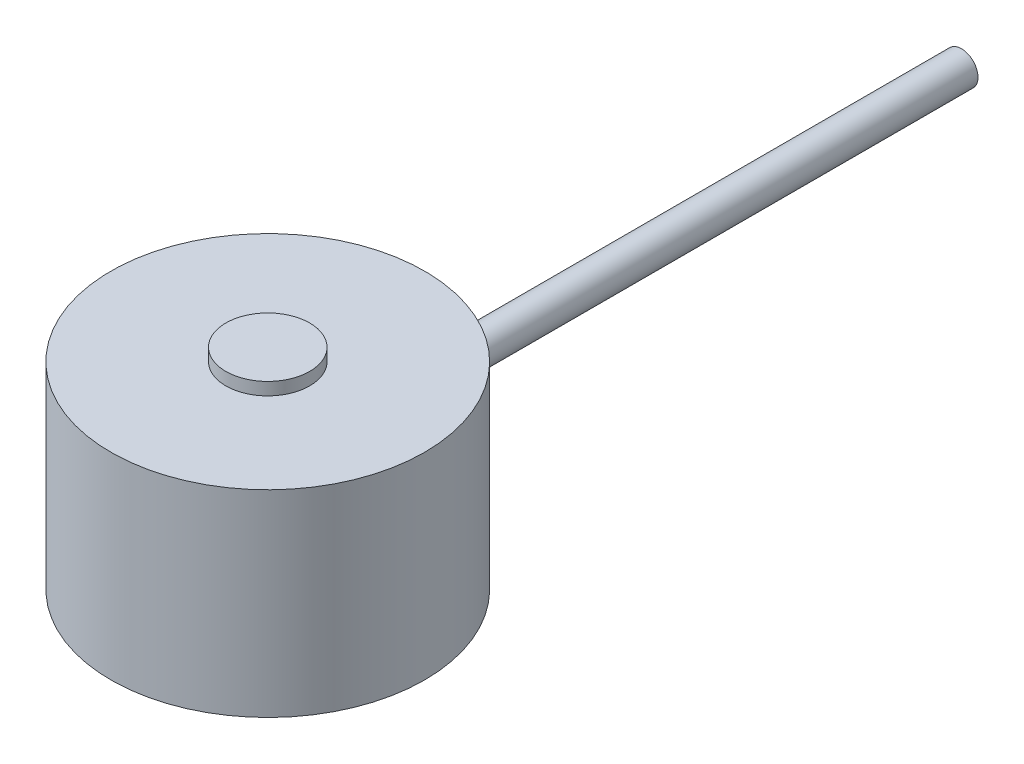
ISO-10303-21;
HEADER;
FILE_DESCRIPTION(('STEP AP214'),'2;1');
FILE_NAME('part.step','',(''),(''),'','','');
FILE_SCHEMA(('AUTOMOTIVE_DESIGN { 1 0 10303 214 1 1 1 1 }'));
ENDSEC;
DATA;
#1=APPLICATION_CONTEXT('core data for automotive mechanical design processes');
#2=APPLICATION_PROTOCOL_DEFINITION('international standard','automotive_design',2000,#1);
#3=PRODUCT_CONTEXT('',#1,'mechanical');
#4=PRODUCT('Part','Part','',(#3));
#5=PRODUCT_RELATED_PRODUCT_CATEGORY('part','',(#4));
#6=PRODUCT_DEFINITION_FORMATION('','',#4);
#7=PRODUCT_DEFINITION_CONTEXT('part definition',#1,'design');
#8=PRODUCT_DEFINITION('design','',#6,#7);
#9=PRODUCT_DEFINITION_SHAPE('','',#8);
#10=(LENGTH_UNIT() NAMED_UNIT(*) SI_UNIT(.MILLI.,.METRE.));
#11=(NAMED_UNIT(*) PLANE_ANGLE_UNIT() SI_UNIT($,.RADIAN.));
#12=(NAMED_UNIT(*) SI_UNIT($,.STERADIAN.) SOLID_ANGLE_UNIT());
#13=UNCERTAINTY_MEASURE_WITH_UNIT(LENGTH_MEASURE(1.E-05),#10,'distance_accuracy_value','');
#14=(GEOMETRIC_REPRESENTATION_CONTEXT(3) GLOBAL_UNCERTAINTY_ASSIGNED_CONTEXT((#13)) GLOBAL_UNIT_ASSIGNED_CONTEXT((#10,
#11,#12)) REPRESENTATION_CONTEXT('',''));
#15=CARTESIAN_POINT('',(0.,0.,0.));
#16=DIRECTION('',(0.,0.,1.));
#17=DIRECTION('',(1.,0.,0.));
#18=AXIS2_PLACEMENT_3D('',#15,#16,#17);
#19=CARTESIAN_POINT('',(9.5,0.,0.));
#20=DIRECTION('',(0.,-1.,0.));
#21=DIRECTION('',(1.,0.,0.));
#22=AXIS2_PLACEMENT_3D('',#19,#20,#21);
#23=PLANE('',#22);
#24=CARTESIAN_POINT('',(0.,0.,0.));
#25=DIRECTION('',(0.,-1.,0.));
#26=DIRECTION('',(1.,0.,0.));
#27=AXIS2_PLACEMENT_3D('',#24,#25,#26);
#28=CIRCLE('',#27,9.5);
#29=CARTESIAN_POINT('',(9.5,0.,0.));
#30=VERTEX_POINT('',#29);
#31=EDGE_CURVE('E57',#30,#30,#28,.T.);
#32=ORIENTED_EDGE('',*,*,#31,.T.);
#33=EDGE_LOOP('',(#32));
#34=FACE_BOUND('',#33,.T.);
#35=ADVANCED_FACE('F33',(#34),#23,.T.);
#36=CARTESIAN_POINT('',(0.,12.7,0.));
#37=DIRECTION('',(0.,1.,0.));
#38=DIRECTION('',(-1.,0.,0.));
#39=AXIS2_PLACEMENT_3D('',#36,#37,#38);
#40=PLANE('',#39);
#41=CARTESIAN_POINT('',(0.,12.7,0.));
#42=DIRECTION('',(0.,-1.,0.));
#43=DIRECTION('',(1.,0.,0.));
#44=AXIS2_PLACEMENT_3D('',#41,#42,#43);
#45=CIRCLE('',#44,2.54);
#46=CARTESIAN_POINT('',(2.54,12.7,0.));
#47=VERTEX_POINT('',#46);
#48=EDGE_CURVE('E44',#47,#47,#45,.T.);
#49=ORIENTED_EDGE('',*,*,#48,.F.);
#50=EDGE_LOOP('',(#49));
#51=FACE_BOUND('',#50,.T.);
#52=ADVANCED_FACE('F74',(#51),#40,.T.);
#53=CARTESIAN_POINT('',(0.,0.,0.));
#54=DIRECTION('',(0.,-1.,0.));
#55=DIRECTION('',(1.,0.,0.));
#56=AXIS2_PLACEMENT_3D('',#53,#54,#55);
#57=CYLINDRICAL_SURFACE('',#56,2.54);
#58=ORIENTED_EDGE('',*,*,#48,.T.);
#59=EDGE_LOOP('',(#58));
#60=FACE_BOUND('',#59,.T.);
#61=CARTESIAN_POINT('',(0.,11.94,0.));
#62=DIRECTION('',(0.,-1.,0.));
#63=DIRECTION('',(1.,0.,0.));
#64=AXIS2_PLACEMENT_3D('',#61,#62,#63);
#65=CIRCLE('',#64,2.54);
#66=CARTESIAN_POINT('',(2.54,11.94,0.));
#67=VERTEX_POINT('',#66);
#68=EDGE_CURVE('E48',#67,#67,#65,.T.);
#69=ORIENTED_EDGE('',*,*,#68,.F.);
#70=EDGE_LOOP('',(#69));
#71=FACE_BOUND('',#70,.T.);
#72=ADVANCED_FACE('F79',(#60,#71),#57,.T.);
#73=CARTESIAN_POINT('',(2.54,11.94,0.));
#74=DIRECTION('',(0.,1.,0.));
#75=DIRECTION('',(-1.,0.,0.));
#76=AXIS2_PLACEMENT_3D('',#73,#74,#75);
#77=PLANE('',#76);
#78=ORIENTED_EDGE('',*,*,#68,.T.);
#79=EDGE_LOOP('',(#78));
#80=FACE_BOUND('',#79,.T.);
#81=CARTESIAN_POINT('',(0.,11.94,0.));
#82=DIRECTION('',(0.,-1.,0.));
#83=DIRECTION('',(1.,0.,0.));
#84=AXIS2_PLACEMENT_3D('',#81,#82,#83);
#85=CIRCLE('',#84,9.5);
#86=CARTESIAN_POINT('',(9.5,11.94,0.));
#87=VERTEX_POINT('',#86);
#88=EDGE_CURVE('E52',#87,#87,#85,.T.);
#89=ORIENTED_EDGE('',*,*,#88,.F.);
#90=EDGE_LOOP('',(#89));
#91=FACE_BOUND('',#90,.T.);
#92=ADVANCED_FACE('F84',(#80,#91),#77,.T.);
#93=CARTESIAN_POINT('',(0.,0.,0.));
#94=DIRECTION('',(0.,-1.,0.));
#95=DIRECTION('',(1.,0.,0.));
#96=AXIS2_PLACEMENT_3D('',#93,#94,#95);
#97=CYLINDRICAL_SURFACE('',#96,9.5);
#98=CARTESIAN_POINT('',(1.,6.35,-9.44722181384559));
#99=CARTESIAN_POINT('',(0.99999758200504,6.29399676022231,-9.447222502664));
#100=CARTESIAN_POINT('',(0.995279605314901,6.2379568797022,-9.44772516447025));
#101=CARTESIAN_POINT('',(0.97653057563843,6.12743197119586,-9.44968112934553));
#102=CARTESIAN_POINT('',(0.962489361408321,6.07294870739155,-9.45113546960823));
#103=CARTESIAN_POINT('',(0.925508243054437,5.96715353672435,-9.45482827329693));
#104=CARTESIAN_POINT('',(0.902573857494191,5.91583968596353,-9.45706625036201));
#105=CARTESIAN_POINT('',(0.848468268709646,5.81780040586029,-9.46207356819287));
#106=CARTESIAN_POINT('',(0.817298657421768,5.77107409210137,-9.46484280623326));
#107=CARTESIAN_POINT('',(0.747473131447721,5.68333797951133,-9.47061306994568));
#108=CARTESIAN_POINT('',(0.708790872156585,5.64234919728408,-9.47361488826576));
#109=CARTESIAN_POINT('',(0.62509450014844,5.56743276042639,-9.47950490283494));
#110=CARTESIAN_POINT('',(0.580080093148767,5.53350543415458,-9.4823930937953));
#111=CARTESIAN_POINT('',(0.484867702730015,5.47360171385311,-9.48773832873555));
#112=CARTESIAN_POINT('',(0.434657894607717,5.44764401557964,-9.49019435323658));
#113=CARTESIAN_POINT('',(0.330561942132095,5.40453602526003,-9.49438988246007));
#114=CARTESIAN_POINT('',(0.276675896397673,5.38738549705754,-9.49612940639459));
#115=CARTESIAN_POINT('',(0.166970075945795,5.36244058881074,-9.49869036912673));
#116=CARTESIAN_POINT('',(0.111158253620165,5.35461158896824,-9.4995152042548));
#117=CARTESIAN_POINT('',(-0.000992835185781556,5.34842482083021,-9.50016541360392));
#118=CARTESIAN_POINT('',(-0.0573320865818033,5.35006678248953,-9.49999081632174));
#119=CARTESIAN_POINT('',(-0.168703652078325,5.36274729442015,-9.49866460674142));
#120=CARTESIAN_POINT('',(-0.223740257380181,5.37374861698648,-9.4975168652733));
#121=CARTESIAN_POINT('',(-0.331181565951239,5.40477752943278,-9.49437776823862));
#122=CARTESIAN_POINT('',(-0.383586231879071,5.42480524733705,-9.49238640070667));
#123=CARTESIAN_POINT('',(-0.484393029454016,5.47335901820799,-9.48777724512953));
#124=CARTESIAN_POINT('',(-0.532787202758798,5.50190147495144,-9.4851582498829));
#125=CARTESIAN_POINT('',(-0.624112447479545,5.56666259333303,-9.47958754859329));
#126=CARTESIAN_POINT('',(-0.667043341182005,5.60288150457432,-9.47663583173319));
#127=CARTESIAN_POINT('',(-0.746441553980418,5.68217661549575,-9.47071386481717));
#128=CARTESIAN_POINT('',(-0.782876524755557,5.72528521174329,-9.46774359429256));
#129=CARTESIAN_POINT('',(-0.847998010788905,5.817023875572,-9.46213353822369));
#130=CARTESIAN_POINT('',(-0.876684512719003,5.86565395265044,-9.45949375324791));
#131=CARTESIAN_POINT('',(-0.925494983579706,5.96708076887816,-9.45484337668269));
#132=CARTESIAN_POINT('',(-0.945616840511517,6.01987853195736,-9.45283294031977));
#133=CARTESIAN_POINT('',(-0.976700646432598,6.12812918602637,-9.44967206522172));
#134=CARTESIAN_POINT('',(-0.987662905352755,6.18358198711122,-9.44852159738819));
#135=CARTESIAN_POINT('',(-1.00007449042647,6.29528430332104,-9.44721601825639));
#136=CARTESIAN_POINT('',(-1.00156912338335,6.3515287310886,-9.44705616649923));
#137=CARTESIAN_POINT('',(-0.995122122181053,6.46346722487839,-9.44773740410882));
#138=CARTESIAN_POINT('',(-0.987180629571162,6.51916129914371,-9.44857847846089));
#139=CARTESIAN_POINT('',(-0.962124760080201,6.62828536167683,-9.45116248557082));
#140=CARTESIAN_POINT('',(-0.945031905000059,6.68172034594203,-9.45290330202064));
#141=CARTESIAN_POINT('',(-0.902180520375013,6.78496489295997,-9.457088931172));
#142=CARTESIAN_POINT('',(-0.876421771630253,6.83477436396822,-9.45953376168103));
#143=CARTESIAN_POINT('',(-0.816856703395603,6.92956019358576,-9.46486340159123));
#144=CARTESIAN_POINT('',(-0.783020420843191,6.97451763017109,-9.46774983441864));
#145=CARTESIAN_POINT('',(-0.708303604881555,7.05813110460675,-9.47363218095351));
#146=CARTESIAN_POINT('',(-0.667422878089003,7.09678696941029,-9.47662809766472));
#147=CARTESIAN_POINT('',(-0.57958081103308,7.16685680342479,-9.48240620792166));
#148=CARTESIAN_POINT('',(-0.532595793455963,7.19824117481112,-9.48518749827024));
#149=CARTESIAN_POINT('',(-0.43399547707484,7.25267324792291,-9.49020976547322));
#150=CARTESIAN_POINT('',(-0.382380247645452,7.27572107452906,-9.49245075042118));
#151=CARTESIAN_POINT('',(-0.276087032602511,7.31277590812539,-9.49613584419318));
#152=CARTESIAN_POINT('',(-0.221415283364818,7.32680064274985,-9.49758151475308));
#153=CARTESIAN_POINT('',(-0.110476924029592,7.34546900480972,-9.49951951574434));
#154=CARTESIAN_POINT('',(-0.0542103639989394,7.35011292641273,-9.50001187606999));
#155=CARTESIAN_POINT('',(0.0580300347921236,7.3498834442607,-9.49998774184331));
#156=CARTESIAN_POINT('',(0.114003974054028,7.34505592746934,-9.49947611139556));
#157=CARTESIAN_POINT('',(0.224340884848703,7.32611701178647,-9.49751109070018));
#158=CARTESIAN_POINT('',(0.278703855507501,7.31200560785844,-9.49605769994164));
#159=CARTESIAN_POINT('',(0.384274195424409,7.27491254193537,-9.49237193768829));
#160=CARTESIAN_POINT('',(0.435482100975529,7.25193239228629,-9.490139699013));
#161=CARTESIAN_POINT('',(0.533321310522368,7.19775899475026,-9.48514475079929));
#162=CARTESIAN_POINT('',(0.579952625423965,7.16656576643549,-9.48238204252499));
#163=CARTESIAN_POINT('',(0.667550047988316,7.09667994304738,-9.4766194383916));
#164=CARTESIAN_POINT('',(0.708488814694206,7.05795316285625,-9.47361849971249));
#165=CARTESIAN_POINT('',(0.783306479853837,6.97416800248141,-9.46772640505434));
#166=CARTESIAN_POINT('',(0.817183686602053,6.92910810942172,-9.46483527551713));
#167=CARTESIAN_POINT('',(0.876992670192273,6.83379663846925,-9.45948152841544));
#168=CARTESIAN_POINT('',(0.902902032073805,6.78353093654307,-9.4570201280027));
#169=CARTESIAN_POINT('',(0.945877463600503,6.6793677382227,-9.45281896154564));
#170=CARTESIAN_POINT('',(0.962953439690973,6.6254743871793,-9.45107838754954));
#171=CARTESIAN_POINT('',(0.98355157501037,6.53440056938451,-9.44895178678448));
#172=CARTESIAN_POINT('',(0.989711221415892,6.49780098379419,-9.44830614572659));
#173=CARTESIAN_POINT('',(0.997936224550725,6.42413961758953,-9.44744093225495));
#174=CARTESIAN_POINT('',(1.00000160087218,6.38707783918775,-9.44722135780237));
#175=CARTESIAN_POINT('',(1.,6.35,-9.44722181384559));
#176=B_SPLINE_CURVE_WITH_KNOTS('',3,(#98,#99,#100,#101,#102,#103,#104,#105,#106,#107,#108,#109,
#110,#111,#112,#113,#114,#115,#116,#117,#118,#119,#120,#121,#122,#123,#124,#125,#126,#127,#128,
#129,#130,#131,#132,#133,#134,#135,#136,#137,#138,#139,#140,#141,#142,#143,#144,#145,#146,#147,
#148,#149,#150,#151,#152,#153,#154,#155,#156,#157,#158,#159,#160,#161,#162,#163,#164,#165,#166,
#167,#168,#169,#170,#171,#172,#173,#174,#175),.UNSPECIFIED.,.T.,.F.,(4,2,2,2,2,2,2,2,2,2,2,2,2,
2,2,2,2,2,2,2,2,2,2,2,2,2,2,2,2,2,2,2,2,2,2,2,2,2,4),(0.,0.167874308515837,0.335931881467919,
0.503885334527947,0.671806344537528,0.840327196784645,1.00885588352368,1.17777694897953,
1.34669348473242,1.51498069435804,1.68326310564076,1.8508792712072,2.01849781420309,
2.18644138555292,2.35439041849688,2.52315376360364,2.69191739899767,2.86072262658684,
3.02952214212699,3.19751326274829,3.36550186340294,3.53309711962096,3.70069661540383,
3.86892774419036,4.03716349197577,4.20607244449903,4.37497886667637,4.54355241740059,
4.71212068184014,4.87987428784667,5.04762798486011,5.21535308824674,5.38307779193977,
5.55158212557546,5.7201267807443,5.8891413337759,6.05796592756898,6.16911032609435,
6.28025419276375),.UNSPECIFIED.);
#177=CARTESIAN_POINT('',(1.,6.35,-9.44722181384559));
#178=VERTEX_POINT('',#177);
#179=EDGE_CURVE('E10',#178,#178,#176,.T.);
#180=ORIENTED_EDGE('',*,*,#179,.F.);
#181=EDGE_LOOP('',(#180));
#182=FACE_BOUND('',#181,.T.);
#183=ORIENTED_EDGE('',*,*,#88,.T.);
#184=EDGE_LOOP('',(#183));
#185=FACE_BOUND('',#184,.T.);
#186=ORIENTED_EDGE('',*,*,#31,.F.);
#187=EDGE_LOOP('',(#186));
#188=FACE_BOUND('',#187,.T.);
#189=ADVANCED_FACE('F72',(#182,#185,#188),#97,.T.);
#190=CARTESIAN_POINT('',(0.,6.35,-42.));
#191=DIRECTION('',(0.,0.,1.));
#192=DIRECTION('',(1.,0.,0.));
#193=AXIS2_PLACEMENT_3D('',#190,#191,#192);
#194=CYLINDRICAL_SURFACE('',#193,1.);
#195=ORIENTED_EDGE('',*,*,#179,.T.);
#196=EDGE_LOOP('',(#195));
#197=FACE_BOUND('',#196,.T.);
#198=CARTESIAN_POINT('',(0.,6.35,-42.));
#199=DIRECTION('',(0.,0.,1.));
#200=DIRECTION('',(1.,0.,0.));
#201=AXIS2_PLACEMENT_3D('',#198,#199,#200);
#202=CIRCLE('',#201,1.);
#203=CARTESIAN_POINT('',(1.,6.35,-42.));
#204=VERTEX_POINT('',#203);
#205=EDGE_CURVE('E60',#204,#204,#202,.T.);
#206=ORIENTED_EDGE('',*,*,#205,.T.);
#207=EDGE_LOOP('',(#206));
#208=FACE_BOUND('',#207,.T.);
#209=ADVANCED_FACE('F64',(#197,#208),#194,.T.);
#210=CARTESIAN_POINT('',(0.,6.35,-42.));
#211=DIRECTION('',(0.,0.,1.));
#212=DIRECTION('',(1.,0.,0.));
#213=AXIS2_PLACEMENT_3D('',#210,#211,#212);
#214=PLANE('',#213);
#215=ORIENTED_EDGE('',*,*,#205,.F.);
#216=EDGE_LOOP('',(#215));
#217=FACE_BOUND('',#216,.T.);
#218=ADVANCED_FACE('F66',(#217),#214,.F.);
#219=CLOSED_SHELL('',(#35,#52,#72,#92,#189,#209,#218));
#220=MANIFOLD_SOLID_BREP('B2',#219);
#221=ADVANCED_BREP_SHAPE_REPRESENTATION('',(#18,#220),#14);
#222=SHAPE_DEFINITION_REPRESENTATION(#9,#221);
ENDSEC;
END-ISO-10303-21;
